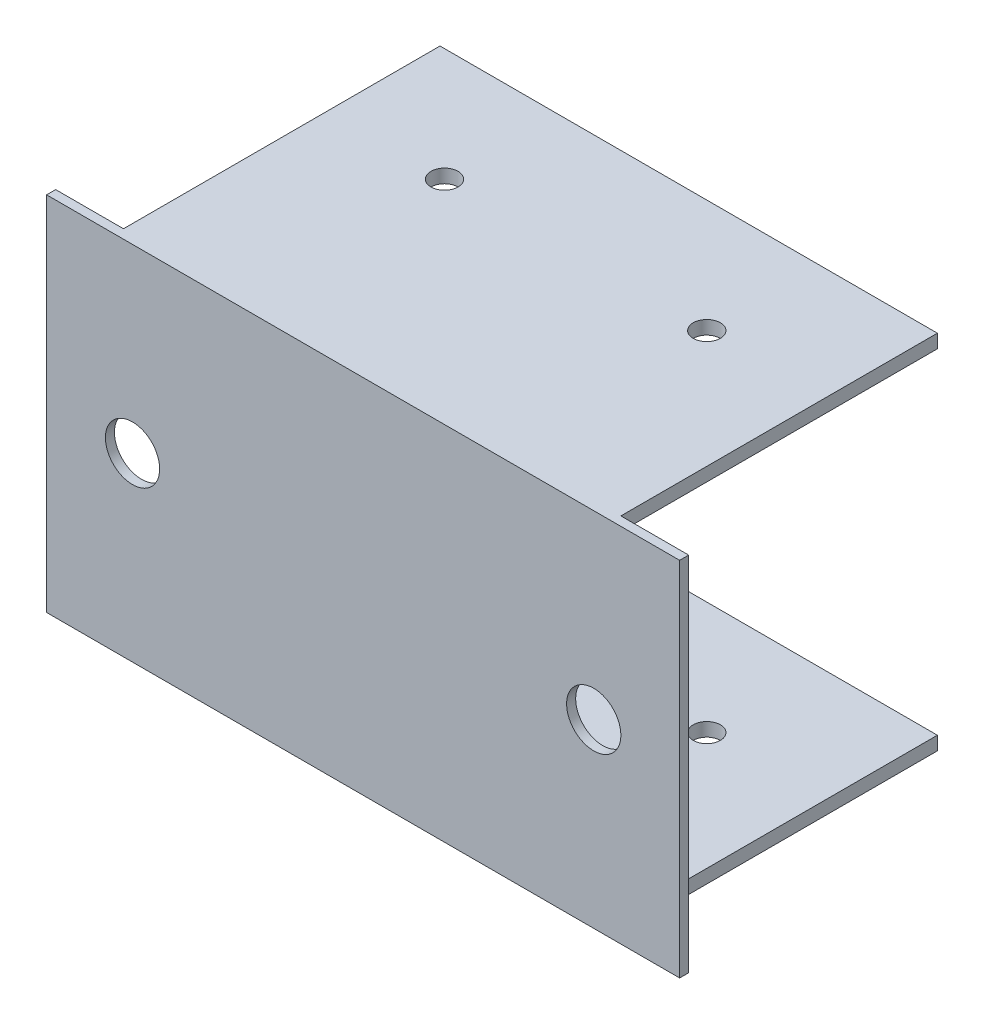
ISO-10303-21;
HEADER;
FILE_DESCRIPTION(('STEP AP214'),'2;1');
FILE_NAME('part.step','',(''),(''),'','','');
FILE_SCHEMA(('AUTOMOTIVE_DESIGN { 1 0 10303 214 1 1 1 1 }'));
ENDSEC;
DATA;
#1=APPLICATION_CONTEXT('core data for automotive mechanical design processes');
#2=APPLICATION_PROTOCOL_DEFINITION('international standard','automotive_design',2000,#1);
#3=PRODUCT_CONTEXT('',#1,'mechanical');
#4=PRODUCT('Part','Part','',(#3));
#5=PRODUCT_RELATED_PRODUCT_CATEGORY('part','',(#4));
#6=PRODUCT_DEFINITION_FORMATION('','',#4);
#7=PRODUCT_DEFINITION_CONTEXT('part definition',#1,'design');
#8=PRODUCT_DEFINITION('design','',#6,#7);
#9=PRODUCT_DEFINITION_SHAPE('','',#8);
#10=(LENGTH_UNIT() NAMED_UNIT(*) SI_UNIT(.MILLI.,.METRE.));
#11=(NAMED_UNIT(*) PLANE_ANGLE_UNIT() SI_UNIT($,.RADIAN.));
#12=(NAMED_UNIT(*) SI_UNIT($,.STERADIAN.) SOLID_ANGLE_UNIT());
#13=UNCERTAINTY_MEASURE_WITH_UNIT(LENGTH_MEASURE(1.E-05),#10,'distance_accuracy_value','');
#14=(GEOMETRIC_REPRESENTATION_CONTEXT(3) GLOBAL_UNCERTAINTY_ASSIGNED_CONTEXT((#13)) GLOBAL_UNIT_ASSIGNED_CONTEXT((#10,
#11,#12)) REPRESENTATION_CONTEXT('',''));
#15=CARTESIAN_POINT('',(0.,0.,0.));
#16=DIRECTION('',(0.,0.,1.));
#17=DIRECTION('',(1.,0.,0.));
#18=AXIS2_PLACEMENT_3D('',#15,#16,#17);
#19=CARTESIAN_POINT('',(0.,0.,0.));
#20=DIRECTION('',(0.,0.,-1.));
#21=DIRECTION('',(-1.,0.,0.));
#22=AXIS2_PLACEMENT_3D('',#19,#20,#21);
#23=PLANE('',#22);
#24=CARTESIAN_POINT('',(25.5,0.,0.));
#25=DIRECTION('',(0.,0.,-1.));
#26=DIRECTION('',(-1.,0.,0.));
#27=AXIS2_PLACEMENT_3D('',#24,#25,#26);
#28=CIRCLE('',#27,3.);
#29=CARTESIAN_POINT('',(22.5,0.,0.));
#30=VERTEX_POINT('',#29);
#31=EDGE_CURVE('E176',#30,#30,#28,.T.);
#32=ORIENTED_EDGE('',*,*,#31,.F.);
#33=EDGE_LOOP('',(#32));
#34=FACE_BOUND('',#33,.T.);
#35=CARTESIAN_POINT('',(-25.5,0.,0.));
#36=DIRECTION('',(0.,0.,-1.));
#37=DIRECTION('',(-1.,0.,0.));
#38=AXIS2_PLACEMENT_3D('',#35,#36,#37);
#39=CIRCLE('',#38,3.);
#40=CARTESIAN_POINT('',(-28.5,0.,0.));
#41=VERTEX_POINT('',#40);
#42=EDGE_CURVE('E180',#41,#41,#39,.T.);
#43=ORIENTED_EDGE('',*,*,#42,.F.);
#44=EDGE_LOOP('',(#43));
#45=FACE_BOUND('',#44,.T.);
#46=DIRECTION('',(1.,0.,0.));
#47=VECTOR('',#46,1.);
#48=CARTESIAN_POINT('',(-35.,-20.,0.));
#49=LINE('',#48,#47);
#50=CARTESIAN_POINT('',(27.5,-20.,0.));
#51=VERTEX_POINT('',#50);
#52=CARTESIAN_POINT('',(35.,-20.,0.));
#53=VERTEX_POINT('',#52);
#54=EDGE_CURVE('E198',#51,#53,#49,.T.);
#55=ORIENTED_EDGE('',*,*,#54,.F.);
#56=DIRECTION('',(0.,1.,0.));
#57=VECTOR('',#56,1.);
#58=CARTESIAN_POINT('',(27.5,0.,0.));
#59=LINE('',#58,#57);
#60=CARTESIAN_POINT('',(27.5,-18.5,0.));
#61=VERTEX_POINT('',#60);
#62=EDGE_CURVE('E11',#51,#61,#59,.T.);
#63=ORIENTED_EDGE('',*,*,#62,.T.);
#64=DIRECTION('',(1.,0.,0.));
#65=VECTOR('',#64,1.);
#66=CARTESIAN_POINT('',(0.,-18.5,0.));
#67=LINE('',#66,#65);
#68=CARTESIAN_POINT('',(-27.5,-18.5,0.));
#69=VERTEX_POINT('',#68);
#70=EDGE_CURVE('E133',#69,#61,#67,.T.);
#71=ORIENTED_EDGE('',*,*,#70,.F.);
#72=DIRECTION('',(0.,-1.,0.));
#73=VECTOR('',#72,1.);
#74=CARTESIAN_POINT('',(-27.5,0.,0.));
#75=LINE('',#74,#73);
#76=CARTESIAN_POINT('',(-27.5,-20.,0.));
#77=VERTEX_POINT('',#76);
#78=EDGE_CURVE('E44',#69,#77,#75,.T.);
#79=ORIENTED_EDGE('',*,*,#78,.T.);
#80=CARTESIAN_POINT('',(-35.,-20.,0.));
#81=VERTEX_POINT('',#80);
#82=EDGE_CURVE('E199',#81,#77,#49,.T.);
#83=ORIENTED_EDGE('',*,*,#82,.F.);
#84=DIRECTION('',(0.,-1.,0.));
#85=VECTOR('',#84,1.);
#86=CARTESIAN_POINT('',(-35.,20.,0.));
#87=LINE('',#86,#85);
#88=CARTESIAN_POINT('',(-35.,20.,0.));
#89=VERTEX_POINT('',#88);
#90=EDGE_CURVE('E184',#89,#81,#87,.T.);
#91=ORIENTED_EDGE('',*,*,#90,.F.);
#92=DIRECTION('',(1.,0.,0.));
#93=VECTOR('',#92,1.);
#94=CARTESIAN_POINT('',(-35.,20.,0.));
#95=LINE('',#94,#93);
#96=CARTESIAN_POINT('',(-27.5,20.,0.));
#97=VERTEX_POINT('',#96);
#98=EDGE_CURVE('E192',#89,#97,#95,.T.);
#99=ORIENTED_EDGE('',*,*,#98,.T.);
#100=DIRECTION('',(0.,1.,0.));
#101=VECTOR('',#100,1.);
#102=CARTESIAN_POINT('',(-27.5,0.,0.));
#103=LINE('',#102,#101);
#104=CARTESIAN_POINT('',(-27.5,18.5,0.));
#105=VERTEX_POINT('',#104);
#106=EDGE_CURVE('E218',#105,#97,#103,.T.);
#107=ORIENTED_EDGE('',*,*,#106,.F.);
#108=DIRECTION('',(1.,0.,0.));
#109=VECTOR('',#108,1.);
#110=CARTESIAN_POINT('',(0.,18.5,0.));
#111=LINE('',#110,#109);
#112=CARTESIAN_POINT('',(27.5,18.5,0.));
#113=VERTEX_POINT('',#112);
#114=EDGE_CURVE('E60',#105,#113,#111,.T.);
#115=ORIENTED_EDGE('',*,*,#114,.T.);
#116=DIRECTION('',(0.,-1.,0.));
#117=VECTOR('',#116,1.);
#118=CARTESIAN_POINT('',(27.5,0.,0.));
#119=LINE('',#118,#117);
#120=CARTESIAN_POINT('',(27.5,20.,0.));
#121=VERTEX_POINT('',#120);
#122=EDGE_CURVE('E221',#121,#113,#119,.T.);
#123=ORIENTED_EDGE('',*,*,#122,.F.);
#124=CARTESIAN_POINT('',(35.,20.,0.));
#125=VERTEX_POINT('',#124);
#126=EDGE_CURVE('E195',#121,#125,#95,.T.);
#127=ORIENTED_EDGE('',*,*,#126,.T.);
#128=DIRECTION('',(0.,-1.,0.));
#129=VECTOR('',#128,1.);
#130=CARTESIAN_POINT('',(35.,20.,0.));
#131=LINE('',#130,#129);
#132=EDGE_CURVE('E194',#125,#53,#131,.T.);
#133=ORIENTED_EDGE('',*,*,#132,.T.);
#134=EDGE_LOOP('',(#55,#63,#71,#79,#83,#91,#99,#107,#115,#123,#127,#133));
#135=FACE_BOUND('',#134,.T.);
#136=ADVANCED_FACE('F35',(#34,#45,#135),#23,.T.);
#137=CARTESIAN_POINT('',(-35.,20.,1.));
#138=DIRECTION('',(0.,1.,0.));
#139=DIRECTION('',(0.,0.,1.));
#140=AXIS2_PLACEMENT_3D('',#137,#138,#139);
#141=PLANE('',#140);
#142=CARTESIAN_POINT('',(14.5,20.,-22.5));
#143=DIRECTION('',(0.,1.,0.));
#144=DIRECTION('',(0.,0.,1.));
#145=AXIS2_PLACEMENT_3D('',#142,#143,#144);
#146=CIRCLE('',#145,1.5);
#147=CARTESIAN_POINT('',(14.5,20.,-21.));
#148=VERTEX_POINT('',#147);
#149=EDGE_CURVE('E441',#148,#148,#146,.T.);
#150=ORIENTED_EDGE('',*,*,#149,.F.);
#151=EDGE_LOOP('',(#150));
#152=FACE_BOUND('',#151,.T.);
#153=CARTESIAN_POINT('',(-14.5,20.,-22.5));
#154=DIRECTION('',(0.,1.,0.));
#155=DIRECTION('',(0.,0.,1.));
#156=AXIS2_PLACEMENT_3D('',#153,#154,#155);
#157=CIRCLE('',#156,1.5);
#158=CARTESIAN_POINT('',(-14.5,20.,-21.));
#159=VERTEX_POINT('',#158);
#160=EDGE_CURVE('E234',#159,#159,#157,.T.);
#161=ORIENTED_EDGE('',*,*,#160,.F.);
#162=EDGE_LOOP('',(#161));
#163=FACE_BOUND('',#162,.T.);
#164=DIRECTION('',(1.,0.,0.));
#165=VECTOR('',#164,1.);
#166=CARTESIAN_POINT('',(-35.,20.,1.));
#167=LINE('',#166,#165);
#168=CARTESIAN_POINT('',(-35.,20.,1.));
#169=VERTEX_POINT('',#168);
#170=CARTESIAN_POINT('',(35.,20.,1.));
#171=VERTEX_POINT('',#170);
#172=EDGE_CURVE('E181',#169,#171,#167,.T.);
#173=ORIENTED_EDGE('',*,*,#172,.T.);
#174=DIRECTION('',(0.,0.,-1.));
#175=VECTOR('',#174,1.);
#176=CARTESIAN_POINT('',(35.,20.,1.));
#177=LINE('',#176,#175);
#178=EDGE_CURVE('E191',#171,#125,#177,.T.);
#179=ORIENTED_EDGE('',*,*,#178,.T.);
#180=ORIENTED_EDGE('',*,*,#126,.F.);
#181=DIRECTION('',(0.,0.,-1.));
#182=VECTOR('',#181,1.);
#183=CARTESIAN_POINT('',(27.5,20.,-35.));
#184=LINE('',#183,#182);
#185=CARTESIAN_POINT('',(27.5,20.,-35.));
#186=VERTEX_POINT('',#185);
#187=EDGE_CURVE('E148',#121,#186,#184,.T.);
#188=ORIENTED_EDGE('',*,*,#187,.T.);
#189=DIRECTION('',(-1.,0.,0.));
#190=VECTOR('',#189,1.);
#191=CARTESIAN_POINT('',(-27.5,20.,-35.));
#192=LINE('',#191,#190);
#193=CARTESIAN_POINT('',(-27.5,20.,-35.));
#194=VERTEX_POINT('',#193);
#195=EDGE_CURVE('E150',#186,#194,#192,.T.);
#196=ORIENTED_EDGE('',*,*,#195,.T.);
#197=DIRECTION('',(0.,0.,1.));
#198=VECTOR('',#197,1.);
#199=CARTESIAN_POINT('',(-27.5,20.,-35.));
#200=LINE('',#199,#198);
#201=EDGE_CURVE('E158',#194,#97,#200,.T.);
#202=ORIENTED_EDGE('',*,*,#201,.T.);
#203=ORIENTED_EDGE('',*,*,#98,.F.);
#204=DIRECTION('',(0.,0.,-1.));
#205=VECTOR('',#204,1.);
#206=CARTESIAN_POINT('',(-35.,20.,1.));
#207=LINE('',#206,#205);
#208=EDGE_CURVE('E203',#169,#89,#207,.T.);
#209=ORIENTED_EDGE('',*,*,#208,.F.);
#210=EDGE_LOOP('',(#173,#179,#180,#188,#196,#202,#203,#209));
#211=FACE_BOUND('',#210,.T.);
#212=ADVANCED_FACE('F37',(#152,#163,#211),#141,.T.);
#213=CARTESIAN_POINT('',(-35.,20.,1.));
#214=DIRECTION('',(1.,0.,0.));
#215=DIRECTION('',(0.,1.,0.));
#216=AXIS2_PLACEMENT_3D('',#213,#214,#215);
#217=PLANE('',#216);
#218=ORIENTED_EDGE('',*,*,#90,.T.);
#219=DIRECTION('',(0.,0.,-1.));
#220=VECTOR('',#219,1.);
#221=CARTESIAN_POINT('',(-35.,-20.,1.));
#222=LINE('',#221,#220);
#223=CARTESIAN_POINT('',(-35.,-20.,1.));
#224=VERTEX_POINT('',#223);
#225=EDGE_CURVE('E205',#224,#81,#222,.T.);
#226=ORIENTED_EDGE('',*,*,#225,.F.);
#227=DIRECTION('',(0.,-1.,0.));
#228=VECTOR('',#227,1.);
#229=CARTESIAN_POINT('',(-35.,20.,1.));
#230=LINE('',#229,#228);
#231=EDGE_CURVE('E189',#169,#224,#230,.T.);
#232=ORIENTED_EDGE('',*,*,#231,.F.);
#233=ORIENTED_EDGE('',*,*,#208,.T.);
#234=EDGE_LOOP('',(#218,#226,#232,#233));
#235=FACE_BOUND('',#234,.T.);
#236=ADVANCED_FACE('F259',(#235),#217,.F.);
#237=CARTESIAN_POINT('',(-35.,-20.,1.));
#238=DIRECTION('',(0.,1.,0.));
#239=DIRECTION('',(0.,0.,1.));
#240=AXIS2_PLACEMENT_3D('',#237,#238,#239);
#241=PLANE('',#240);
#242=CARTESIAN_POINT('',(14.5,-20.,-22.5));
#243=DIRECTION('',(0.,1.,0.));
#244=DIRECTION('',(0.,0.,1.));
#245=AXIS2_PLACEMENT_3D('',#242,#243,#244);
#246=CIRCLE('',#245,1.5);
#247=CARTESIAN_POINT('',(14.5,-20.,-21.));
#248=VERTEX_POINT('',#247);
#249=EDGE_CURVE('E445',#248,#248,#246,.T.);
#250=ORIENTED_EDGE('',*,*,#249,.T.);
#251=EDGE_LOOP('',(#250));
#252=FACE_BOUND('',#251,.T.);
#253=CARTESIAN_POINT('',(-14.5,-20.,-22.5));
#254=DIRECTION('',(0.,1.,0.));
#255=DIRECTION('',(0.,0.,1.));
#256=AXIS2_PLACEMENT_3D('',#253,#254,#255);
#257=CIRCLE('',#256,1.5);
#258=CARTESIAN_POINT('',(-14.5,-20.,-21.));
#259=VERTEX_POINT('',#258);
#260=EDGE_CURVE('E228',#259,#259,#257,.T.);
#261=ORIENTED_EDGE('',*,*,#260,.T.);
#262=EDGE_LOOP('',(#261));
#263=FACE_BOUND('',#262,.T.);
#264=DIRECTION('',(0.,0.,-1.));
#265=VECTOR('',#264,1.);
#266=CARTESIAN_POINT('',(35.,-20.,1.));
#267=LINE('',#266,#265);
#268=CARTESIAN_POINT('',(35.,-20.,1.));
#269=VERTEX_POINT('',#268);
#270=EDGE_CURVE('E208',#269,#53,#267,.T.);
#271=ORIENTED_EDGE('',*,*,#270,.F.);
#272=DIRECTION('',(1.,0.,0.));
#273=VECTOR('',#272,1.);
#274=CARTESIAN_POINT('',(-35.,-20.,1.));
#275=LINE('',#274,#273);
#276=EDGE_CURVE('E187',#224,#269,#275,.T.);
#277=ORIENTED_EDGE('',*,*,#276,.F.);
#278=ORIENTED_EDGE('',*,*,#225,.T.);
#279=ORIENTED_EDGE('',*,*,#82,.T.);
#280=DIRECTION('',(0.,0.,1.));
#281=VECTOR('',#280,1.);
#282=CARTESIAN_POINT('',(-27.5,-20.,-35.));
#283=LINE('',#282,#281);
#284=CARTESIAN_POINT('',(-27.5,-20.,-35.));
#285=VERTEX_POINT('',#284);
#286=EDGE_CURVE('E136',#285,#77,#283,.T.);
#287=ORIENTED_EDGE('',*,*,#286,.F.);
#288=DIRECTION('',(-1.,0.,0.));
#289=VECTOR('',#288,1.);
#290=CARTESIAN_POINT('',(-27.5,-20.,-35.));
#291=LINE('',#290,#289);
#292=CARTESIAN_POINT('',(27.5,-20.,-35.));
#293=VERTEX_POINT('',#292);
#294=EDGE_CURVE('E246',#293,#285,#291,.T.);
#295=ORIENTED_EDGE('',*,*,#294,.F.);
#296=DIRECTION('',(0.,0.,-1.));
#297=VECTOR('',#296,1.);
#298=CARTESIAN_POINT('',(27.5,-20.,-35.));
#299=LINE('',#298,#297);
#300=EDGE_CURVE('E52',#51,#293,#299,.T.);
#301=ORIENTED_EDGE('',*,*,#300,.F.);
#302=ORIENTED_EDGE('',*,*,#54,.T.);
#303=EDGE_LOOP('',(#271,#277,#278,#279,#287,#295,#301,#302));
#304=FACE_BOUND('',#303,.T.);
#305=ADVANCED_FACE('F254',(#252,#263,#304),#241,.F.);
#306=CARTESIAN_POINT('',(35.,20.,1.));
#307=DIRECTION('',(1.,0.,0.));
#308=DIRECTION('',(0.,0.,-1.));
#309=AXIS2_PLACEMENT_3D('',#306,#307,#308);
#310=PLANE('',#309);
#311=ORIENTED_EDGE('',*,*,#132,.F.);
#312=ORIENTED_EDGE('',*,*,#178,.F.);
#313=DIRECTION('',(0.,-1.,0.));
#314=VECTOR('',#313,1.);
#315=CARTESIAN_POINT('',(35.,20.,1.));
#316=LINE('',#315,#314);
#317=EDGE_CURVE('E183',#171,#269,#316,.T.);
#318=ORIENTED_EDGE('',*,*,#317,.T.);
#319=ORIENTED_EDGE('',*,*,#270,.T.);
#320=EDGE_LOOP('',(#311,#312,#318,#319));
#321=FACE_BOUND('',#320,.T.);
#322=ADVANCED_FACE('F304',(#321),#310,.T.);
#323=CARTESIAN_POINT('',(0.,0.,1.));
#324=DIRECTION('',(0.,0.,-1.));
#325=DIRECTION('',(-1.,0.,0.));
#326=AXIS2_PLACEMENT_3D('',#323,#324,#325);
#327=PLANE('',#326);
#328=ORIENTED_EDGE('',*,*,#276,.T.);
#329=ORIENTED_EDGE('',*,*,#317,.F.);
#330=ORIENTED_EDGE('',*,*,#172,.F.);
#331=ORIENTED_EDGE('',*,*,#231,.T.);
#332=EDGE_LOOP('',(#328,#329,#330,#331));
#333=FACE_BOUND('',#332,.T.);
#334=CARTESIAN_POINT('',(-25.5,0.,1.));
#335=DIRECTION('',(0.,0.,1.));
#336=DIRECTION('',(1.,0.,0.));
#337=AXIS2_PLACEMENT_3D('',#334,#335,#336);
#338=CIRCLE('',#337,3.);
#339=CARTESIAN_POINT('',(-22.5,0.,1.));
#340=VERTEX_POINT('',#339);
#341=EDGE_CURVE('E177',#340,#340,#338,.T.);
#342=ORIENTED_EDGE('',*,*,#341,.F.);
#343=EDGE_LOOP('',(#342));
#344=FACE_BOUND('',#343,.T.);
#345=CARTESIAN_POINT('',(25.5,0.,1.));
#346=DIRECTION('',(0.,0.,1.));
#347=DIRECTION('',(1.,0.,0.));
#348=AXIS2_PLACEMENT_3D('',#345,#346,#347);
#349=CIRCLE('',#348,3.);
#350=CARTESIAN_POINT('',(28.5,0.,1.));
#351=VERTEX_POINT('',#350);
#352=EDGE_CURVE('E171',#351,#351,#349,.T.);
#353=ORIENTED_EDGE('',*,*,#352,.F.);
#354=EDGE_LOOP('',(#353));
#355=FACE_BOUND('',#354,.T.);
#356=ADVANCED_FACE('F299',(#333,#344,#355),#327,.F.);
#357=CARTESIAN_POINT('',(-25.5,0.,-9.));
#358=DIRECTION('',(0.,0.,1.));
#359=DIRECTION('',(1.,0.,0.));
#360=AXIS2_PLACEMENT_3D('',#357,#358,#359);
#361=CYLINDRICAL_SURFACE('',#360,3.);
#362=ORIENTED_EDGE('',*,*,#42,.T.);
#363=EDGE_LOOP('',(#362));
#364=FACE_BOUND('',#363,.T.);
#365=ORIENTED_EDGE('',*,*,#341,.T.);
#366=EDGE_LOOP('',(#365));
#367=FACE_BOUND('',#366,.T.);
#368=ADVANCED_FACE('F311',(#364,#367),#361,.F.);
#369=CARTESIAN_POINT('',(25.5,0.,-9.));
#370=DIRECTION('',(0.,0.,1.));
#371=DIRECTION('',(1.,0.,0.));
#372=AXIS2_PLACEMENT_3D('',#369,#370,#371);
#373=CYLINDRICAL_SURFACE('',#372,3.);
#374=ORIENTED_EDGE('',*,*,#31,.T.);
#375=EDGE_LOOP('',(#374));
#376=FACE_BOUND('',#375,.T.);
#377=ORIENTED_EDGE('',*,*,#352,.T.);
#378=EDGE_LOOP('',(#377));
#379=FACE_BOUND('',#378,.T.);
#380=ADVANCED_FACE('F321',(#376,#379),#373,.F.);
#381=CARTESIAN_POINT('',(27.5,18.5,-35.));
#382=DIRECTION('',(1.,0.,0.));
#383=DIRECTION('',(0.,0.,-1.));
#384=AXIS2_PLACEMENT_3D('',#381,#382,#383);
#385=PLANE('',#384);
#386=ORIENTED_EDGE('',*,*,#187,.F.);
#387=ORIENTED_EDGE('',*,*,#122,.T.);
#388=DIRECTION('',(0.,0.,-1.));
#389=VECTOR('',#388,1.);
#390=CARTESIAN_POINT('',(27.5,18.5,-35.));
#391=LINE('',#390,#389);
#392=CARTESIAN_POINT('',(27.5,18.5,-35.));
#393=VERTEX_POINT('',#392);
#394=EDGE_CURVE('E155',#113,#393,#391,.T.);
#395=ORIENTED_EDGE('',*,*,#394,.T.);
#396=DIRECTION('',(0.,1.,0.));
#397=VECTOR('',#396,1.);
#398=CARTESIAN_POINT('',(27.5,18.5,-35.));
#399=LINE('',#398,#397);
#400=EDGE_CURVE('E163',#393,#186,#399,.T.);
#401=ORIENTED_EDGE('',*,*,#400,.T.);
#402=EDGE_LOOP('',(#386,#387,#395,#401));
#403=FACE_BOUND('',#402,.T.);
#404=ADVANCED_FACE('F275',(#403),#385,.T.);
#405=CARTESIAN_POINT('',(-27.5,18.5,-35.));
#406=DIRECTION('',(-1.,0.,0.));
#407=DIRECTION('',(0.,0.,1.));
#408=AXIS2_PLACEMENT_3D('',#405,#406,#407);
#409=PLANE('',#408);
#410=DIRECTION('',(0.,0.,1.));
#411=VECTOR('',#410,1.);
#412=CARTESIAN_POINT('',(-27.5,18.5,-35.));
#413=LINE('',#412,#411);
#414=CARTESIAN_POINT('',(-27.5,18.5,-35.));
#415=VERTEX_POINT('',#414);
#416=EDGE_CURVE('E161',#415,#105,#413,.T.);
#417=ORIENTED_EDGE('',*,*,#416,.T.);
#418=ORIENTED_EDGE('',*,*,#106,.T.);
#419=ORIENTED_EDGE('',*,*,#201,.F.);
#420=DIRECTION('',(0.,1.,0.));
#421=VECTOR('',#420,1.);
#422=CARTESIAN_POINT('',(-27.5,18.5,-35.));
#423=LINE('',#422,#421);
#424=EDGE_CURVE('E169',#415,#194,#423,.T.);
#425=ORIENTED_EDGE('',*,*,#424,.F.);
#426=EDGE_LOOP('',(#417,#418,#419,#425));
#427=FACE_BOUND('',#426,.T.);
#428=ADVANCED_FACE('F266',(#427),#409,.T.);
#429=CARTESIAN_POINT('',(-27.5,18.5,-35.));
#430=DIRECTION('',(0.,0.,-1.));
#431=DIRECTION('',(-1.,0.,0.));
#432=AXIS2_PLACEMENT_3D('',#429,#430,#431);
#433=PLANE('',#432);
#434=ORIENTED_EDGE('',*,*,#195,.F.);
#435=ORIENTED_EDGE('',*,*,#400,.F.);
#436=DIRECTION('',(-1.,0.,0.));
#437=VECTOR('',#436,1.);
#438=CARTESIAN_POINT('',(-27.5,18.5,-35.));
#439=LINE('',#438,#437);
#440=EDGE_CURVE('E157',#393,#415,#439,.T.);
#441=ORIENTED_EDGE('',*,*,#440,.T.);
#442=ORIENTED_EDGE('',*,*,#424,.T.);
#443=EDGE_LOOP('',(#434,#435,#441,#442));
#444=FACE_BOUND('',#443,.T.);
#445=ADVANCED_FACE('F277',(#444),#433,.T.);
#446=CARTESIAN_POINT('',(0.,18.5,0.));
#447=DIRECTION('',(0.,1.,0.));
#448=DIRECTION('',(0.,0.,1.));
#449=AXIS2_PLACEMENT_3D('',#446,#447,#448);
#450=PLANE('',#449);
#451=CARTESIAN_POINT('',(14.5,18.5,-22.5));
#452=DIRECTION('',(0.,1.,0.));
#453=DIRECTION('',(0.,0.,1.));
#454=AXIS2_PLACEMENT_3D('',#451,#452,#453);
#455=CIRCLE('',#454,1.5);
#456=CARTESIAN_POINT('',(14.5,18.5,-21.));
#457=VERTEX_POINT('',#456);
#458=EDGE_CURVE('E239',#457,#457,#455,.T.);
#459=ORIENTED_EDGE('',*,*,#458,.T.);
#460=EDGE_LOOP('',(#459));
#461=FACE_BOUND('',#460,.T.);
#462=CARTESIAN_POINT('',(-14.5,18.5,-22.5));
#463=DIRECTION('',(0.,1.,0.));
#464=DIRECTION('',(0.,0.,1.));
#465=AXIS2_PLACEMENT_3D('',#462,#463,#464);
#466=CIRCLE('',#465,1.5);
#467=CARTESIAN_POINT('',(-14.5,18.5,-21.));
#468=VERTEX_POINT('',#467);
#469=EDGE_CURVE('E227',#468,#468,#466,.T.);
#470=ORIENTED_EDGE('',*,*,#469,.T.);
#471=EDGE_LOOP('',(#470));
#472=FACE_BOUND('',#471,.T.);
#473=ORIENTED_EDGE('',*,*,#114,.F.);
#474=ORIENTED_EDGE('',*,*,#416,.F.);
#475=ORIENTED_EDGE('',*,*,#440,.F.);
#476=ORIENTED_EDGE('',*,*,#394,.F.);
#477=EDGE_LOOP('',(#473,#474,#475,#476));
#478=FACE_BOUND('',#477,.T.);
#479=ADVANCED_FACE('F270',(#461,#472,#478),#450,.F.);
#480=CARTESIAN_POINT('',(27.5,-18.5,-35.));
#481=DIRECTION('',(-1.,0.,0.));
#482=DIRECTION('',(0.,0.,1.));
#483=AXIS2_PLACEMENT_3D('',#480,#481,#482);
#484=PLANE('',#483);
#485=ORIENTED_EDGE('',*,*,#62,.F.);
#486=ORIENTED_EDGE('',*,*,#300,.T.);
#487=DIRECTION('',(0.,-1.,0.));
#488=VECTOR('',#487,1.);
#489=CARTESIAN_POINT('',(27.5,-18.5,-35.));
#490=LINE('',#489,#488);
#491=CARTESIAN_POINT('',(27.5,-18.5,-35.));
#492=VERTEX_POINT('',#491);
#493=EDGE_CURVE('E141',#492,#293,#490,.T.);
#494=ORIENTED_EDGE('',*,*,#493,.F.);
#495=DIRECTION('',(0.,0.,-1.));
#496=VECTOR('',#495,1.);
#497=CARTESIAN_POINT('',(27.5,-18.5,-35.));
#498=LINE('',#497,#496);
#499=EDGE_CURVE('E126',#61,#492,#498,.T.);
#500=ORIENTED_EDGE('',*,*,#499,.F.);
#501=EDGE_LOOP('',(#485,#486,#494,#500));
#502=FACE_BOUND('',#501,.T.);
#503=ADVANCED_FACE('F147',(#502),#484,.F.);
#504=CARTESIAN_POINT('',(-27.5,-18.5,-35.));
#505=DIRECTION('',(0.,0.,1.));
#506=DIRECTION('',(1.,0.,0.));
#507=AXIS2_PLACEMENT_3D('',#504,#505,#506);
#508=PLANE('',#507);
#509=ORIENTED_EDGE('',*,*,#294,.T.);
#510=DIRECTION('',(0.,-1.,0.));
#511=VECTOR('',#510,1.);
#512=CARTESIAN_POINT('',(-27.5,-18.5,-35.));
#513=LINE('',#512,#511);
#514=CARTESIAN_POINT('',(-27.5,-18.5,-35.));
#515=VERTEX_POINT('',#514);
#516=EDGE_CURVE('E143',#515,#285,#513,.T.);
#517=ORIENTED_EDGE('',*,*,#516,.F.);
#518=DIRECTION('',(-1.,0.,0.));
#519=VECTOR('',#518,1.);
#520=CARTESIAN_POINT('',(-27.5,-18.5,-35.));
#521=LINE('',#520,#519);
#522=EDGE_CURVE('E130',#492,#515,#521,.T.);
#523=ORIENTED_EDGE('',*,*,#522,.F.);
#524=ORIENTED_EDGE('',*,*,#493,.T.);
#525=EDGE_LOOP('',(#509,#517,#523,#524));
#526=FACE_BOUND('',#525,.T.);
#527=ADVANCED_FACE('F140',(#526),#508,.F.);
#528=CARTESIAN_POINT('',(-27.5,-18.5,-35.));
#529=DIRECTION('',(1.,0.,0.));
#530=DIRECTION('',(0.,0.,-1.));
#531=AXIS2_PLACEMENT_3D('',#528,#529,#530);
#532=PLANE('',#531);
#533=ORIENTED_EDGE('',*,*,#78,.F.);
#534=DIRECTION('',(0.,0.,1.));
#535=VECTOR('',#534,1.);
#536=CARTESIAN_POINT('',(-27.5,-18.5,-35.));
#537=LINE('',#536,#535);
#538=EDGE_CURVE('E145',#515,#69,#537,.T.);
#539=ORIENTED_EDGE('',*,*,#538,.F.);
#540=ORIENTED_EDGE('',*,*,#516,.T.);
#541=ORIENTED_EDGE('',*,*,#286,.T.);
#542=EDGE_LOOP('',(#533,#539,#540,#541));
#543=FACE_BOUND('',#542,.T.);
#544=ADVANCED_FACE('F249',(#543),#532,.F.);
#545=CARTESIAN_POINT('',(0.,-18.5,0.));
#546=DIRECTION('',(0.,1.,0.));
#547=DIRECTION('',(0.,0.,1.));
#548=AXIS2_PLACEMENT_3D('',#545,#546,#547);
#549=PLANE('',#548);
#550=CARTESIAN_POINT('',(14.5,-18.5,-22.5));
#551=DIRECTION('',(0.,1.,0.));
#552=DIRECTION('',(0.,0.,1.));
#553=AXIS2_PLACEMENT_3D('',#550,#551,#552);
#554=CIRCLE('',#553,1.5);
#555=CARTESIAN_POINT('',(14.5,-18.5,-21.));
#556=VERTEX_POINT('',#555);
#557=EDGE_CURVE('E39',#556,#556,#554,.T.);
#558=ORIENTED_EDGE('',*,*,#557,.F.);
#559=EDGE_LOOP('',(#558));
#560=FACE_BOUND('',#559,.T.);
#561=CARTESIAN_POINT('',(-14.5,-18.5,-22.5));
#562=DIRECTION('',(0.,1.,0.));
#563=DIRECTION('',(0.,0.,1.));
#564=AXIS2_PLACEMENT_3D('',#561,#562,#563);
#565=CIRCLE('',#564,1.5);
#566=CARTESIAN_POINT('',(-14.5,-18.5,-21.));
#567=VERTEX_POINT('',#566);
#568=EDGE_CURVE('E225',#567,#567,#565,.T.);
#569=ORIENTED_EDGE('',*,*,#568,.F.);
#570=EDGE_LOOP('',(#569));
#571=FACE_BOUND('',#570,.T.);
#572=ORIENTED_EDGE('',*,*,#538,.T.);
#573=ORIENTED_EDGE('',*,*,#70,.T.);
#574=ORIENTED_EDGE('',*,*,#499,.T.);
#575=ORIENTED_EDGE('',*,*,#522,.T.);
#576=EDGE_LOOP('',(#572,#573,#574,#575));
#577=FACE_BOUND('',#576,.T.);
#578=ADVANCED_FACE('F129',(#560,#571,#577),#549,.T.);
#579=CARTESIAN_POINT('',(-14.5,-20.,-22.5));
#580=DIRECTION('',(0.,1.,0.));
#581=DIRECTION('',(0.,0.,1.));
#582=AXIS2_PLACEMENT_3D('',#579,#580,#581);
#583=CYLINDRICAL_SURFACE('',#582,1.5);
#584=ORIENTED_EDGE('',*,*,#568,.T.);
#585=EDGE_LOOP('',(#584));
#586=FACE_BOUND('',#585,.T.);
#587=ORIENTED_EDGE('',*,*,#260,.F.);
#588=EDGE_LOOP('',(#587));
#589=FACE_BOUND('',#588,.T.);
#590=ADVANCED_FACE('F397',(#586,#589),#583,.F.);
#591=ORIENTED_EDGE('',*,*,#160,.T.);
#592=EDGE_LOOP('',(#591));
#593=FACE_BOUND('',#592,.T.);
#594=ORIENTED_EDGE('',*,*,#469,.F.);
#595=EDGE_LOOP('',(#594));
#596=FACE_BOUND('',#595,.T.);
#597=ADVANCED_FACE('F407',(#593,#596),#583,.F.);
#598=CARTESIAN_POINT('',(14.5,-20.,-22.5));
#599=DIRECTION('',(0.,1.,0.));
#600=DIRECTION('',(0.,0.,1.));
#601=AXIS2_PLACEMENT_3D('',#598,#599,#600);
#602=CYLINDRICAL_SURFACE('',#601,1.5);
#603=ORIENTED_EDGE('',*,*,#557,.T.);
#604=EDGE_LOOP('',(#603));
#605=FACE_BOUND('',#604,.T.);
#606=ORIENTED_EDGE('',*,*,#249,.F.);
#607=EDGE_LOOP('',(#606));
#608=FACE_BOUND('',#607,.T.);
#609=ADVANCED_FACE('F416',(#605,#608),#602,.F.);
#610=ORIENTED_EDGE('',*,*,#149,.T.);
#611=EDGE_LOOP('',(#610));
#612=FACE_BOUND('',#611,.T.);
#613=ORIENTED_EDGE('',*,*,#458,.F.);
#614=EDGE_LOOP('',(#613));
#615=FACE_BOUND('',#614,.T.);
#616=ADVANCED_FACE('F425',(#612,#615),#602,.F.);
#617=CLOSED_SHELL('',(#136,#212,#236,#305,#322,#356,#368,#380,#404,#428,#445,#479,#503,#527,
#544,#578,#590,#597,#609,#616));
#618=MANIFOLD_SOLID_BREP('B2',#617);
#619=ADVANCED_BREP_SHAPE_REPRESENTATION('',(#18,#618),#14);
#620=SHAPE_DEFINITION_REPRESENTATION(#9,#619);
ENDSEC;
END-ISO-10303-21;
